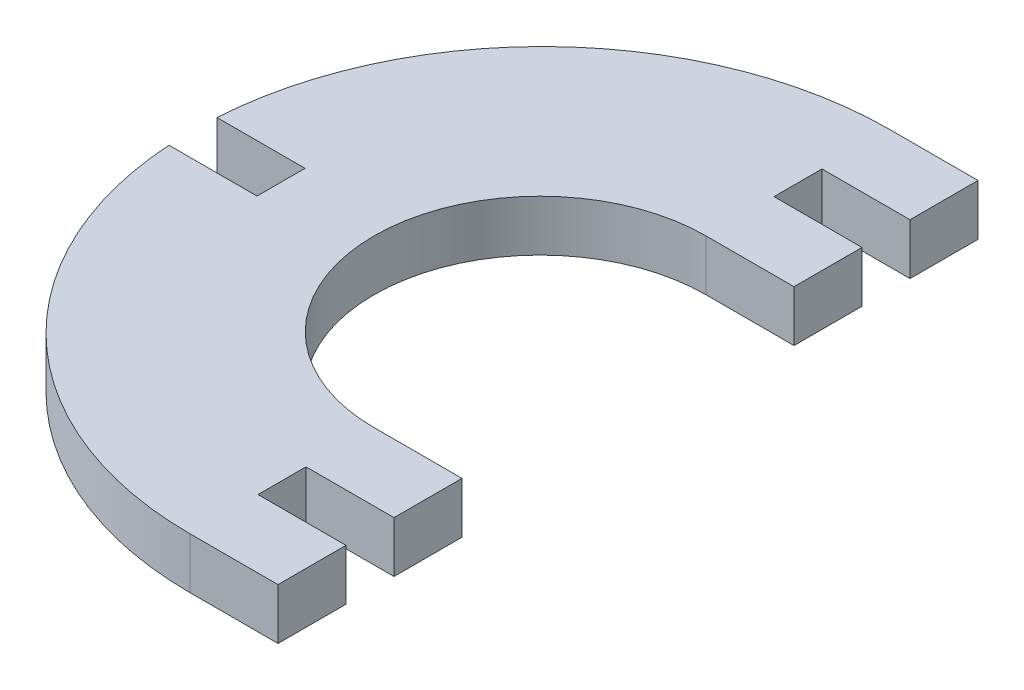
ISO-10303-21;
HEADER;
FILE_DESCRIPTION(('STEP AP214'),'2;1');
FILE_NAME('part.step','',(''),(''),'','','');
FILE_SCHEMA(('AUTOMOTIVE_DESIGN { 1 0 10303 214 1 1 1 1 }'));
ENDSEC;
DATA;
#1=APPLICATION_CONTEXT('core data for automotive mechanical design processes');
#2=APPLICATION_PROTOCOL_DEFINITION('international standard','automotive_design',2000,#1);
#3=PRODUCT_CONTEXT('',#1,'mechanical');
#4=PRODUCT('Part','Part','',(#3));
#5=PRODUCT_RELATED_PRODUCT_CATEGORY('part','',(#4));
#6=PRODUCT_DEFINITION_FORMATION('','',#4);
#7=PRODUCT_DEFINITION_CONTEXT('part definition',#1,'design');
#8=PRODUCT_DEFINITION('design','',#6,#7);
#9=PRODUCT_DEFINITION_SHAPE('','',#8);
#10=(LENGTH_UNIT() NAMED_UNIT(*) SI_UNIT(.MILLI.,.METRE.));
#11=(NAMED_UNIT(*) PLANE_ANGLE_UNIT() SI_UNIT($,.RADIAN.));
#12=(NAMED_UNIT(*) SI_UNIT($,.STERADIAN.) SOLID_ANGLE_UNIT());
#13=UNCERTAINTY_MEASURE_WITH_UNIT(LENGTH_MEASURE(1.E-05),#10,'distance_accuracy_value','');
#14=(GEOMETRIC_REPRESENTATION_CONTEXT(3) GLOBAL_UNCERTAINTY_ASSIGNED_CONTEXT((#13)) GLOBAL_UNIT_ASSIGNED_CONTEXT((#10,
#11,#12)) REPRESENTATION_CONTEXT('',''));
#15=CARTESIAN_POINT('',(0.,0.,0.));
#16=DIRECTION('',(0.,0.,1.));
#17=DIRECTION('',(1.,0.,0.));
#18=AXIS2_PLACEMENT_3D('',#15,#16,#17);
#19=CARTESIAN_POINT('',(0.,5.1,0.));
#20=DIRECTION('',(0.,0.,-1.));
#21=DIRECTION('',(-1.,0.,0.));
#22=AXIS2_PLACEMENT_3D('',#19,#20,#21);
#23=PLANE('',#22);
#24=DIRECTION('',(1.,0.,0.));
#25=VECTOR('',#24,1.);
#26=CARTESIAN_POINT('',(0.,0.,0.));
#27=LINE('',#26,#25);
#28=CARTESIAN_POINT('',(-8.8,0.,0.));
#29=VERTEX_POINT('',#28);
#30=CARTESIAN_POINT('',(0.,0.,0.));
#31=VERTEX_POINT('',#30);
#32=EDGE_CURVE('E201',#29,#31,#27,.T.);
#33=ORIENTED_EDGE('',*,*,#32,.T.);
#34=DIRECTION('',(0.,-1.,0.));
#35=VECTOR('',#34,1.);
#36=CARTESIAN_POINT('',(0.,5.1,0.));
#37=LINE('',#36,#35);
#38=CARTESIAN_POINT('',(0.,5.1,0.));
#39=VERTEX_POINT('',#38);
#40=EDGE_CURVE('E11',#39,#31,#37,.T.);
#41=ORIENTED_EDGE('',*,*,#40,.F.);
#42=DIRECTION('',(1.,0.,0.));
#43=VECTOR('',#42,1.);
#44=CARTESIAN_POINT('',(0.,5.1,0.));
#45=LINE('',#44,#43);
#46=CARTESIAN_POINT('',(-8.8,5.1,0.));
#47=VERTEX_POINT('',#46);
#48=EDGE_CURVE('E239',#47,#39,#45,.T.);
#49=ORIENTED_EDGE('',*,*,#48,.F.);
#50=DIRECTION('',(0.,-1.,0.));
#51=VECTOR('',#50,1.);
#52=CARTESIAN_POINT('',(-8.8,5.1,0.));
#53=LINE('',#52,#51);
#54=EDGE_CURVE('E197',#47,#29,#53,.T.);
#55=ORIENTED_EDGE('',*,*,#54,.T.);
#56=EDGE_LOOP('',(#33,#41,#49,#55));
#57=FACE_BOUND('',#56,.T.);
#58=ADVANCED_FACE('F33',(#57),#23,.F.);
#59=CARTESIAN_POINT('',(0.,5.1,0.));
#60=DIRECTION('',(-1.,0.,0.));
#61=DIRECTION('',(0.,0.,1.));
#62=AXIS2_PLACEMENT_3D('',#59,#60,#61);
#63=PLANE('',#62);
#64=DIRECTION('',(0.,0.,-1.));
#65=VECTOR('',#64,1.);
#66=CARTESIAN_POINT('',(0.,0.,0.));
#67=LINE('',#66,#65);
#68=CARTESIAN_POINT('',(0.,0.,-6.8));
#69=VERTEX_POINT('',#68);
#70=EDGE_CURVE('E204',#31,#69,#67,.T.);
#71=ORIENTED_EDGE('',*,*,#70,.T.);
#72=DIRECTION('',(0.,-1.,0.));
#73=VECTOR('',#72,1.);
#74=CARTESIAN_POINT('',(0.,5.1,-6.8));
#75=LINE('',#74,#73);
#76=CARTESIAN_POINT('',(0.,5.1,-6.8));
#77=VERTEX_POINT('',#76);
#78=EDGE_CURVE('E41',#77,#69,#75,.T.);
#79=ORIENTED_EDGE('',*,*,#78,.F.);
#80=DIRECTION('',(0.,0.,-1.));
#81=VECTOR('',#80,1.);
#82=CARTESIAN_POINT('',(0.,5.1,0.));
#83=LINE('',#82,#81);
#84=EDGE_CURVE('E128',#39,#77,#83,.T.);
#85=ORIENTED_EDGE('',*,*,#84,.F.);
#86=ORIENTED_EDGE('',*,*,#40,.T.);
#87=EDGE_LOOP('',(#71,#79,#85,#86));
#88=FACE_BOUND('',#87,.T.);
#89=ADVANCED_FACE('F357',(#88),#63,.F.);
#90=CARTESIAN_POINT('',(0.,5.1,-6.8));
#91=DIRECTION('',(0.,0.,1.));
#92=DIRECTION('',(1.,0.,0.));
#93=AXIS2_PLACEMENT_3D('',#90,#91,#92);
#94=PLANE('',#93);
#95=DIRECTION('',(-1.,0.,0.));
#96=VECTOR('',#95,1.);
#97=CARTESIAN_POINT('',(0.,0.,-6.8));
#98=LINE('',#97,#96);
#99=CARTESIAN_POINT('',(-8.8,0.,-6.8));
#100=VERTEX_POINT('',#99);
#101=EDGE_CURVE('E206',#69,#100,#98,.T.);
#102=ORIENTED_EDGE('',*,*,#101,.T.);
#103=DIRECTION('',(0.,-1.,0.));
#104=VECTOR('',#103,1.);
#105=CARTESIAN_POINT('',(-8.8,5.1,-6.8));
#106=LINE('',#105,#104);
#107=CARTESIAN_POINT('',(-8.8,5.1,-6.8));
#108=VERTEX_POINT('',#107);
#109=EDGE_CURVE('E282',#108,#100,#106,.T.);
#110=ORIENTED_EDGE('',*,*,#109,.F.);
#111=DIRECTION('',(-1.,0.,0.));
#112=VECTOR('',#111,1.);
#113=CARTESIAN_POINT('',(0.,5.1,-6.8));
#114=LINE('',#113,#112);
#115=EDGE_CURVE('E290',#77,#108,#114,.T.);
#116=ORIENTED_EDGE('',*,*,#115,.F.);
#117=ORIENTED_EDGE('',*,*,#78,.T.);
#118=EDGE_LOOP('',(#102,#110,#116,#117));
#119=FACE_BOUND('',#118,.T.);
#120=ADVANCED_FACE('F288',(#119),#94,.F.);
#121=CARTESIAN_POINT('',(-8.8,5.1,-6.8));
#122=DIRECTION('',(-1.,0.,0.));
#123=DIRECTION('',(0.,0.,1.));
#124=AXIS2_PLACEMENT_3D('',#121,#122,#123);
#125=PLANE('',#124);
#126=DIRECTION('',(0.,0.,-1.));
#127=VECTOR('',#126,1.);
#128=CARTESIAN_POINT('',(-8.8,0.,-6.8));
#129=LINE('',#128,#127);
#130=CARTESIAN_POINT('',(-8.8,0.,-11.6));
#131=VERTEX_POINT('',#130);
#132=EDGE_CURVE('E208',#100,#131,#129,.T.);
#133=ORIENTED_EDGE('',*,*,#132,.T.);
#134=DIRECTION('',(0.,-1.,0.));
#135=VECTOR('',#134,1.);
#136=CARTESIAN_POINT('',(-8.8,5.1,-11.6));
#137=LINE('',#136,#135);
#138=CARTESIAN_POINT('',(-8.8,5.1,-11.6));
#139=VERTEX_POINT('',#138);
#140=EDGE_CURVE('E279',#139,#131,#137,.T.);
#141=ORIENTED_EDGE('',*,*,#140,.F.);
#142=DIRECTION('',(0.,0.,-1.));
#143=VECTOR('',#142,1.);
#144=CARTESIAN_POINT('',(-8.8,5.1,-6.8));
#145=LINE('',#144,#143);
#146=EDGE_CURVE('E308',#108,#139,#145,.T.);
#147=ORIENTED_EDGE('',*,*,#146,.F.);
#148=ORIENTED_EDGE('',*,*,#109,.T.);
#149=EDGE_LOOP('',(#133,#141,#147,#148));
#150=FACE_BOUND('',#149,.T.);
#151=ADVANCED_FACE('F299',(#150),#125,.F.);
#152=CARTESIAN_POINT('',(-8.8,5.1,-11.6));
#153=DIRECTION('',(0.,0.,-1.));
#154=DIRECTION('',(-1.,0.,0.));
#155=AXIS2_PLACEMENT_3D('',#152,#153,#154);
#156=PLANE('',#155);
#157=DIRECTION('',(1.,0.,0.));
#158=VECTOR('',#157,1.);
#159=CARTESIAN_POINT('',(-8.8,0.,-11.6));
#160=LINE('',#159,#158);
#161=CARTESIAN_POINT('',(0.,0.,-11.6));
#162=VERTEX_POINT('',#161);
#163=EDGE_CURVE('E210',#131,#162,#160,.T.);
#164=ORIENTED_EDGE('',*,*,#163,.T.);
#165=DIRECTION('',(0.,-1.,0.));
#166=VECTOR('',#165,1.);
#167=CARTESIAN_POINT('',(0.,5.1,-11.6));
#168=LINE('',#167,#166);
#169=CARTESIAN_POINT('',(0.,5.1,-11.6));
#170=VERTEX_POINT('',#169);
#171=EDGE_CURVE('E276',#170,#162,#168,.T.);
#172=ORIENTED_EDGE('',*,*,#171,.F.);
#173=DIRECTION('',(1.,0.,0.));
#174=VECTOR('',#173,1.);
#175=CARTESIAN_POINT('',(-8.8,5.1,-11.6));
#176=LINE('',#175,#174);
#177=EDGE_CURVE('E305',#139,#170,#176,.T.);
#178=ORIENTED_EDGE('',*,*,#177,.F.);
#179=ORIENTED_EDGE('',*,*,#140,.T.);
#180=EDGE_LOOP('',(#164,#172,#178,#179));
#181=FACE_BOUND('',#180,.T.);
#182=ADVANCED_FACE('F303',(#181),#156,.F.);
#183=CARTESIAN_POINT('',(0.,5.1,-11.6));
#184=DIRECTION('',(-1.,0.,0.));
#185=DIRECTION('',(0.,0.,1.));
#186=AXIS2_PLACEMENT_3D('',#183,#184,#185);
#187=PLANE('',#186);
#188=DIRECTION('',(0.,0.,-1.));
#189=VECTOR('',#188,1.);
#190=CARTESIAN_POINT('',(0.,0.,-11.6));
#191=LINE('',#190,#189);
#192=CARTESIAN_POINT('',(0.,0.,-18.4));
#193=VERTEX_POINT('',#192);
#194=EDGE_CURVE('E212',#162,#193,#191,.T.);
#195=ORIENTED_EDGE('',*,*,#194,.T.);
#196=DIRECTION('',(0.,-1.,0.));
#197=VECTOR('',#196,1.);
#198=CARTESIAN_POINT('',(0.,5.1,-18.4));
#199=LINE('',#198,#197);
#200=CARTESIAN_POINT('',(0.,5.1,-18.4));
#201=VERTEX_POINT('',#200);
#202=EDGE_CURVE('E273',#201,#193,#199,.T.);
#203=ORIENTED_EDGE('',*,*,#202,.F.);
#204=DIRECTION('',(0.,0.,-1.));
#205=VECTOR('',#204,1.);
#206=CARTESIAN_POINT('',(0.,5.1,-11.6));
#207=LINE('',#206,#205);
#208=EDGE_CURVE('E307',#170,#201,#207,.T.);
#209=ORIENTED_EDGE('',*,*,#208,.F.);
#210=ORIENTED_EDGE('',*,*,#171,.T.);
#211=EDGE_LOOP('',(#195,#203,#209,#210));
#212=FACE_BOUND('',#211,.T.);
#213=ADVANCED_FACE('F370',(#212),#187,.F.);
#214=CARTESIAN_POINT('',(0.,5.1,-18.4));
#215=DIRECTION('',(0.,0.,1.));
#216=DIRECTION('',(1.,0.,0.));
#217=AXIS2_PLACEMENT_3D('',#214,#215,#216);
#218=PLANE('',#217);
#219=DIRECTION('',(-1.,0.,0.));
#220=VECTOR('',#219,1.);
#221=CARTESIAN_POINT('',(0.,0.,-18.4));
#222=LINE('',#221,#220);
#223=CARTESIAN_POINT('',(-8.8,0.,-18.4));
#224=VERTEX_POINT('',#223);
#225=EDGE_CURVE('E214',#193,#224,#222,.T.);
#226=ORIENTED_EDGE('',*,*,#225,.T.);
#227=DIRECTION('',(0.,-1.,0.));
#228=VECTOR('',#227,1.);
#229=CARTESIAN_POINT('',(-8.8,5.1,-18.4));
#230=LINE('',#229,#228);
#231=CARTESIAN_POINT('',(-8.8,5.1,-18.4));
#232=VERTEX_POINT('',#231);
#233=EDGE_CURVE('E270',#232,#224,#230,.T.);
#234=ORIENTED_EDGE('',*,*,#233,.F.);
#235=DIRECTION('',(-1.,0.,0.));
#236=VECTOR('',#235,1.);
#237=CARTESIAN_POINT('',(0.,5.1,-18.4));
#238=LINE('',#237,#236);
#239=EDGE_CURVE('E310',#201,#232,#238,.T.);
#240=ORIENTED_EDGE('',*,*,#239,.F.);
#241=ORIENTED_EDGE('',*,*,#202,.T.);
#242=EDGE_LOOP('',(#226,#234,#240,#241));
#243=FACE_BOUND('',#242,.T.);
#244=ADVANCED_FACE('F373',(#243),#218,.F.);
#245=CARTESIAN_POINT('',(-8.8,5.1,-35.));
#246=DIRECTION('',(0.,-1.,0.));
#247=DIRECTION('',(0.,0.,-1.));
#248=AXIS2_PLACEMENT_3D('',#245,#246,#247);
#249=CYLINDRICAL_SURFACE('',#248,16.6);
#250=CARTESIAN_POINT('',(-8.8,0.,-35.));
#251=DIRECTION('',(0.,-1.,0.));
#252=DIRECTION('',(0.,0.,1.));
#253=AXIS2_PLACEMENT_3D('',#250,#251,#252);
#254=CIRCLE('',#253,16.6);
#255=CARTESIAN_POINT('',(-8.8,0.,-51.6));
#256=VERTEX_POINT('',#255);
#257=EDGE_CURVE('E216',#224,#256,#254,.T.);
#258=ORIENTED_EDGE('',*,*,#257,.T.);
#259=DIRECTION('',(0.,-1.,0.));
#260=VECTOR('',#259,1.);
#261=CARTESIAN_POINT('',(-8.8,5.1,-51.6));
#262=LINE('',#261,#260);
#263=CARTESIAN_POINT('',(-8.8,5.1,-51.6));
#264=VERTEX_POINT('',#263);
#265=EDGE_CURVE('E267',#264,#256,#262,.T.);
#266=ORIENTED_EDGE('',*,*,#265,.F.);
#267=CARTESIAN_POINT('',(-8.8,5.1,-35.));
#268=DIRECTION('',(0.,-1.,0.));
#269=DIRECTION('',(0.,0.,1.));
#270=AXIS2_PLACEMENT_3D('',#267,#268,#269);
#271=CIRCLE('',#270,16.6);
#272=EDGE_CURVE('E316',#232,#264,#271,.T.);
#273=ORIENTED_EDGE('',*,*,#272,.F.);
#274=ORIENTED_EDGE('',*,*,#233,.T.);
#275=EDGE_LOOP('',(#258,#266,#273,#274));
#276=FACE_BOUND('',#275,.T.);
#277=ADVANCED_FACE('F377',(#276),#249,.F.);
#278=CARTESIAN_POINT('',(-8.8,5.1,-51.6));
#279=DIRECTION('',(0.,0.,-1.));
#280=DIRECTION('',(-1.,0.,0.));
#281=AXIS2_PLACEMENT_3D('',#278,#279,#280);
#282=PLANE('',#281);
#283=DIRECTION('',(1.,0.,0.));
#284=VECTOR('',#283,1.);
#285=CARTESIAN_POINT('',(-8.8,0.,-51.6));
#286=LINE('',#285,#284);
#287=CARTESIAN_POINT('',(0.,0.,-51.6));
#288=VERTEX_POINT('',#287);
#289=EDGE_CURVE('E218',#256,#288,#286,.T.);
#290=ORIENTED_EDGE('',*,*,#289,.T.);
#291=DIRECTION('',(0.,-1.,0.));
#292=VECTOR('',#291,1.);
#293=CARTESIAN_POINT('',(0.,5.1,-51.6));
#294=LINE('',#293,#292);
#295=CARTESIAN_POINT('',(0.,5.1,-51.6));
#296=VERTEX_POINT('',#295);
#297=EDGE_CURVE('E264',#296,#288,#294,.T.);
#298=ORIENTED_EDGE('',*,*,#297,.F.);
#299=DIRECTION('',(1.,0.,0.));
#300=VECTOR('',#299,1.);
#301=CARTESIAN_POINT('',(-8.8,5.1,-51.6));
#302=LINE('',#301,#300);
#303=EDGE_CURVE('E318',#264,#296,#302,.T.);
#304=ORIENTED_EDGE('',*,*,#303,.F.);
#305=ORIENTED_EDGE('',*,*,#265,.T.);
#306=EDGE_LOOP('',(#290,#298,#304,#305));
#307=FACE_BOUND('',#306,.T.);
#308=ADVANCED_FACE('F381',(#307),#282,.F.);
#309=CARTESIAN_POINT('',(0.,5.1,-51.6));
#310=DIRECTION('',(-1.,0.,0.));
#311=DIRECTION('',(0.,0.,1.));
#312=AXIS2_PLACEMENT_3D('',#309,#310,#311);
#313=PLANE('',#312);
#314=DIRECTION('',(0.,0.,-1.));
#315=VECTOR('',#314,1.);
#316=CARTESIAN_POINT('',(0.,0.,-51.6));
#317=LINE('',#316,#315);
#318=CARTESIAN_POINT('',(0.,0.,-58.4));
#319=VERTEX_POINT('',#318);
#320=EDGE_CURVE('E220',#288,#319,#317,.T.);
#321=ORIENTED_EDGE('',*,*,#320,.T.);
#322=DIRECTION('',(0.,-1.,0.));
#323=VECTOR('',#322,1.);
#324=CARTESIAN_POINT('',(0.,5.1,-58.4));
#325=LINE('',#324,#323);
#326=CARTESIAN_POINT('',(0.,5.1,-58.4));
#327=VERTEX_POINT('',#326);
#328=EDGE_CURVE('E261',#327,#319,#325,.T.);
#329=ORIENTED_EDGE('',*,*,#328,.F.);
#330=DIRECTION('',(0.,0.,-1.));
#331=VECTOR('',#330,1.);
#332=CARTESIAN_POINT('',(0.,5.1,-51.6));
#333=LINE('',#332,#331);
#334=EDGE_CURVE('E320',#296,#327,#333,.T.);
#335=ORIENTED_EDGE('',*,*,#334,.F.);
#336=ORIENTED_EDGE('',*,*,#297,.T.);
#337=EDGE_LOOP('',(#321,#329,#335,#336));
#338=FACE_BOUND('',#337,.T.);
#339=ADVANCED_FACE('F385',(#338),#313,.F.);
#340=CARTESIAN_POINT('',(0.,5.1,-58.4));
#341=DIRECTION('',(0.,0.,1.));
#342=DIRECTION('',(1.,0.,0.));
#343=AXIS2_PLACEMENT_3D('',#340,#341,#342);
#344=PLANE('',#343);
#345=DIRECTION('',(-1.,0.,0.));
#346=VECTOR('',#345,1.);
#347=CARTESIAN_POINT('',(0.,0.,-58.4));
#348=LINE('',#347,#346);
#349=CARTESIAN_POINT('',(-8.8,0.,-58.4));
#350=VERTEX_POINT('',#349);
#351=EDGE_CURVE('E222',#319,#350,#348,.T.);
#352=ORIENTED_EDGE('',*,*,#351,.T.);
#353=DIRECTION('',(0.,-1.,0.));
#354=VECTOR('',#353,1.);
#355=CARTESIAN_POINT('',(-8.8,5.1,-58.4));
#356=LINE('',#355,#354);
#357=CARTESIAN_POINT('',(-8.8,5.1,-58.4));
#358=VERTEX_POINT('',#357);
#359=EDGE_CURVE('E258',#358,#350,#356,.T.);
#360=ORIENTED_EDGE('',*,*,#359,.F.);
#361=DIRECTION('',(-1.,0.,0.));
#362=VECTOR('',#361,1.);
#363=CARTESIAN_POINT('',(0.,5.1,-58.4));
#364=LINE('',#363,#362);
#365=EDGE_CURVE('E322',#327,#358,#364,.T.);
#366=ORIENTED_EDGE('',*,*,#365,.F.);
#367=ORIENTED_EDGE('',*,*,#328,.T.);
#368=EDGE_LOOP('',(#352,#360,#366,#367));
#369=FACE_BOUND('',#368,.T.);
#370=ADVANCED_FACE('F389',(#369),#344,.F.);
#371=CARTESIAN_POINT('',(-8.8,5.1,-58.4));
#372=DIRECTION('',(-1.,0.,0.));
#373=DIRECTION('',(0.,0.,1.));
#374=AXIS2_PLACEMENT_3D('',#371,#372,#373);
#375=PLANE('',#374);
#376=DIRECTION('',(0.,0.,-1.));
#377=VECTOR('',#376,1.);
#378=CARTESIAN_POINT('',(-8.8,0.,-58.4));
#379=LINE('',#378,#377);
#380=CARTESIAN_POINT('',(-8.8,0.,-63.2));
#381=VERTEX_POINT('',#380);
#382=EDGE_CURVE('E224',#350,#381,#379,.T.);
#383=ORIENTED_EDGE('',*,*,#382,.T.);
#384=DIRECTION('',(0.,-1.,0.));
#385=VECTOR('',#384,1.);
#386=CARTESIAN_POINT('',(-8.8,5.1,-63.2));
#387=LINE('',#386,#385);
#388=CARTESIAN_POINT('',(-8.8,5.1,-63.2));
#389=VERTEX_POINT('',#388);
#390=EDGE_CURVE('E255',#389,#381,#387,.T.);
#391=ORIENTED_EDGE('',*,*,#390,.F.);
#392=DIRECTION('',(0.,0.,-1.));
#393=VECTOR('',#392,1.);
#394=CARTESIAN_POINT('',(-8.8,5.1,-58.4));
#395=LINE('',#394,#393);
#396=EDGE_CURVE('E324',#358,#389,#395,.T.);
#397=ORIENTED_EDGE('',*,*,#396,.F.);
#398=ORIENTED_EDGE('',*,*,#359,.T.);
#399=EDGE_LOOP('',(#383,#391,#397,#398));
#400=FACE_BOUND('',#399,.T.);
#401=ADVANCED_FACE('F393',(#400),#375,.F.);
#402=CARTESIAN_POINT('',(-8.8,5.1,-63.2));
#403=DIRECTION('',(0.,0.,-1.));
#404=DIRECTION('',(-1.,0.,0.));
#405=AXIS2_PLACEMENT_3D('',#402,#403,#404);
#406=PLANE('',#405);
#407=DIRECTION('',(1.,0.,0.));
#408=VECTOR('',#407,1.);
#409=CARTESIAN_POINT('',(-8.8,0.,-63.2));
#410=LINE('',#409,#408);
#411=CARTESIAN_POINT('',(0.,0.,-63.2));
#412=VERTEX_POINT('',#411);
#413=EDGE_CURVE('E226',#381,#412,#410,.T.);
#414=ORIENTED_EDGE('',*,*,#413,.T.);
#415=DIRECTION('',(0.,-1.,0.));
#416=VECTOR('',#415,1.);
#417=CARTESIAN_POINT('',(0.,5.1,-63.2));
#418=LINE('',#417,#416);
#419=CARTESIAN_POINT('',(0.,5.1,-63.2));
#420=VERTEX_POINT('',#419);
#421=EDGE_CURVE('E252',#420,#412,#418,.T.);
#422=ORIENTED_EDGE('',*,*,#421,.F.);
#423=DIRECTION('',(1.,0.,0.));
#424=VECTOR('',#423,1.);
#425=CARTESIAN_POINT('',(-8.8,5.1,-63.2));
#426=LINE('',#425,#424);
#427=EDGE_CURVE('E326',#389,#420,#426,.T.);
#428=ORIENTED_EDGE('',*,*,#427,.F.);
#429=ORIENTED_EDGE('',*,*,#390,.T.);
#430=EDGE_LOOP('',(#414,#422,#428,#429));
#431=FACE_BOUND('',#430,.T.);
#432=ADVANCED_FACE('F397',(#431),#406,.F.);
#433=CARTESIAN_POINT('',(0.,5.1,-63.2));
#434=DIRECTION('',(-1.,0.,0.));
#435=DIRECTION('',(0.,0.,1.));
#436=AXIS2_PLACEMENT_3D('',#433,#434,#435);
#437=PLANE('',#436);
#438=DIRECTION('',(0.,0.,-1.));
#439=VECTOR('',#438,1.);
#440=CARTESIAN_POINT('',(0.,0.,-63.2));
#441=LINE('',#440,#439);
#442=CARTESIAN_POINT('',(0.,0.,-70.));
#443=VERTEX_POINT('',#442);
#444=EDGE_CURVE('E228',#412,#443,#441,.T.);
#445=ORIENTED_EDGE('',*,*,#444,.T.);
#446=DIRECTION('',(0.,-1.,0.));
#447=VECTOR('',#446,1.);
#448=CARTESIAN_POINT('',(0.,5.1,-70.));
#449=LINE('',#448,#447);
#450=CARTESIAN_POINT('',(0.,5.1,-70.));
#451=VERTEX_POINT('',#450);
#452=EDGE_CURVE('E249',#451,#443,#449,.T.);
#453=ORIENTED_EDGE('',*,*,#452,.F.);
#454=DIRECTION('',(0.,0.,-1.));
#455=VECTOR('',#454,1.);
#456=CARTESIAN_POINT('',(0.,5.1,-63.2));
#457=LINE('',#456,#455);
#458=EDGE_CURVE('E328',#420,#451,#457,.T.);
#459=ORIENTED_EDGE('',*,*,#458,.F.);
#460=ORIENTED_EDGE('',*,*,#421,.T.);
#461=EDGE_LOOP('',(#445,#453,#459,#460));
#462=FACE_BOUND('',#461,.T.);
#463=ADVANCED_FACE('F401',(#462),#437,.F.);
#464=CARTESIAN_POINT('',(0.,5.1,-70.));
#465=DIRECTION('',(0.,0.,1.));
#466=DIRECTION('',(1.,0.,0.));
#467=AXIS2_PLACEMENT_3D('',#464,#465,#466);
#468=PLANE('',#467);
#469=DIRECTION('',(-1.,0.,0.));
#470=VECTOR('',#469,1.);
#471=CARTESIAN_POINT('',(0.,0.,-70.));
#472=LINE('',#471,#470);
#473=CARTESIAN_POINT('',(-8.8,0.,-70.));
#474=VERTEX_POINT('',#473);
#475=EDGE_CURVE('E230',#443,#474,#472,.T.);
#476=ORIENTED_EDGE('',*,*,#475,.T.);
#477=DIRECTION('',(0.,-1.,0.));
#478=VECTOR('',#477,1.);
#479=CARTESIAN_POINT('',(-8.8,5.1,-70.));
#480=LINE('',#479,#478);
#481=CARTESIAN_POINT('',(-8.8,5.1,-70.));
#482=VERTEX_POINT('',#481);
#483=EDGE_CURVE('E246',#482,#474,#480,.T.);
#484=ORIENTED_EDGE('',*,*,#483,.F.);
#485=DIRECTION('',(-1.,0.,0.));
#486=VECTOR('',#485,1.);
#487=CARTESIAN_POINT('',(0.,5.1,-70.));
#488=LINE('',#487,#486);
#489=EDGE_CURVE('E330',#451,#482,#488,.T.);
#490=ORIENTED_EDGE('',*,*,#489,.F.);
#491=ORIENTED_EDGE('',*,*,#452,.T.);
#492=EDGE_LOOP('',(#476,#484,#490,#491));
#493=FACE_BOUND('',#492,.T.);
#494=ADVANCED_FACE('F405',(#493),#468,.F.);
#495=CARTESIAN_POINT('',(-8.80000000000001,5.1,-35.2323619631902));
#496=DIRECTION('',(0.,-1.,0.));
#497=DIRECTION('',(0.,0.,-1.));
#498=AXIS2_PLACEMENT_3D('',#495,#496,#497);
#499=CYLINDRICAL_SURFACE('',#498,34.7676380368098);
#500=CARTESIAN_POINT('',(-8.80000000000001,0.,-35.2323619631902));
#501=DIRECTION('',(0.,1.,0.));
#502=DIRECTION('',(0.,0.,1.));
#503=AXIS2_PLACEMENT_3D('',#500,#501,#502);
#504=CIRCLE('',#503,34.7676380368098);
#505=CARTESIAN_POINT('',(-43.5,0.,-37.4));
#506=VERTEX_POINT('',#505);
#507=EDGE_CURVE('E232',#474,#506,#504,.T.);
#508=ORIENTED_EDGE('',*,*,#507,.T.);
#509=DIRECTION('',(0.,-1.,0.));
#510=VECTOR('',#509,1.);
#511=CARTESIAN_POINT('',(-43.5,5.1,-37.4));
#512=LINE('',#511,#510);
#513=CARTESIAN_POINT('',(-43.5,5.1,-37.4));
#514=VERTEX_POINT('',#513);
#515=EDGE_CURVE('E243',#514,#506,#512,.T.);
#516=ORIENTED_EDGE('',*,*,#515,.F.);
#517=CARTESIAN_POINT('',(-8.80000000000001,5.1,-35.2323619631902));
#518=DIRECTION('',(0.,1.,0.));
#519=DIRECTION('',(0.,0.,1.));
#520=AXIS2_PLACEMENT_3D('',#517,#518,#519);
#521=CIRCLE('',#520,34.7676380368098);
#522=EDGE_CURVE('E332',#482,#514,#521,.T.);
#523=ORIENTED_EDGE('',*,*,#522,.F.);
#524=ORIENTED_EDGE('',*,*,#483,.T.);
#525=EDGE_LOOP('',(#508,#516,#523,#524));
#526=FACE_BOUND('',#525,.T.);
#527=ADVANCED_FACE('F338',(#526),#499,.T.);
#528=CARTESIAN_POINT('',(-34.7,5.1,-37.4));
#529=DIRECTION('',(0.,0.,-1.));
#530=DIRECTION('',(-1.,0.,0.));
#531=AXIS2_PLACEMENT_3D('',#528,#529,#530);
#532=PLANE('',#531);
#533=DIRECTION('',(1.,0.,0.));
#534=VECTOR('',#533,1.);
#535=CARTESIAN_POINT('',(-34.7,0.,-37.4));
#536=LINE('',#535,#534);
#537=CARTESIAN_POINT('',(-34.7,0.,-37.4));
#538=VERTEX_POINT('',#537);
#539=EDGE_CURVE('E234',#506,#538,#536,.T.);
#540=ORIENTED_EDGE('',*,*,#539,.T.);
#541=DIRECTION('',(0.,-1.,0.));
#542=VECTOR('',#541,1.);
#543=CARTESIAN_POINT('',(-34.7,5.1,-37.4));
#544=LINE('',#543,#542);
#545=CARTESIAN_POINT('',(-34.7,5.1,-37.4));
#546=VERTEX_POINT('',#545);
#547=EDGE_CURVE('E192',#546,#538,#544,.T.);
#548=ORIENTED_EDGE('',*,*,#547,.F.);
#549=DIRECTION('',(1.,0.,0.));
#550=VECTOR('',#549,1.);
#551=CARTESIAN_POINT('',(-34.7,5.1,-37.4));
#552=LINE('',#551,#550);
#553=EDGE_CURVE('E183',#514,#546,#552,.T.);
#554=ORIENTED_EDGE('',*,*,#553,.F.);
#555=ORIENTED_EDGE('',*,*,#515,.T.);
#556=EDGE_LOOP('',(#540,#548,#554,#555));
#557=FACE_BOUND('',#556,.T.);
#558=ADVANCED_FACE('F342',(#557),#532,.F.);
#559=CARTESIAN_POINT('',(-34.7,5.1,-37.4));
#560=DIRECTION('',(1.,0.,0.));
#561=DIRECTION('',(0.,0.,-1.));
#562=AXIS2_PLACEMENT_3D('',#559,#560,#561);
#563=PLANE('',#562);
#564=DIRECTION('',(0.,0.,1.));
#565=VECTOR('',#564,1.);
#566=CARTESIAN_POINT('',(-34.7,0.,-37.4));
#567=LINE('',#566,#565);
#568=CARTESIAN_POINT('',(-34.7,0.,-32.6));
#569=VERTEX_POINT('',#568);
#570=EDGE_CURVE('E191',#538,#569,#567,.T.);
#571=ORIENTED_EDGE('',*,*,#570,.T.);
#572=DIRECTION('',(0.,-1.,0.));
#573=VECTOR('',#572,1.);
#574=CARTESIAN_POINT('',(-34.7,5.1,-32.6));
#575=LINE('',#574,#573);
#576=CARTESIAN_POINT('',(-34.7,5.1,-32.6));
#577=VERTEX_POINT('',#576);
#578=EDGE_CURVE('E188',#577,#569,#575,.T.);
#579=ORIENTED_EDGE('',*,*,#578,.F.);
#580=DIRECTION('',(0.,0.,1.));
#581=VECTOR('',#580,1.);
#582=CARTESIAN_POINT('',(-34.7,5.1,-37.4));
#583=LINE('',#582,#581);
#584=EDGE_CURVE('E177',#546,#577,#583,.T.);
#585=ORIENTED_EDGE('',*,*,#584,.F.);
#586=ORIENTED_EDGE('',*,*,#547,.T.);
#587=EDGE_LOOP('',(#571,#579,#585,#586));
#588=FACE_BOUND('',#587,.T.);
#589=ADVANCED_FACE('F189',(#588),#563,.F.);
#590=CARTESIAN_POINT('',(-34.7,5.1,-32.6));
#591=DIRECTION('',(0.,0.,1.));
#592=DIRECTION('',(1.,0.,0.));
#593=AXIS2_PLACEMENT_3D('',#590,#591,#592);
#594=PLANE('',#593);
#595=DIRECTION('',(-1.,0.,0.));
#596=VECTOR('',#595,1.);
#597=CARTESIAN_POINT('',(-34.7,0.,-32.6));
#598=LINE('',#597,#596);
#599=CARTESIAN_POINT('',(-43.5,0.,-32.6));
#600=VERTEX_POINT('',#599);
#601=EDGE_CURVE('E114',#569,#600,#598,.T.);
#602=ORIENTED_EDGE('',*,*,#601,.T.);
#603=DIRECTION('',(0.,-1.,0.));
#604=VECTOR('',#603,1.);
#605=CARTESIAN_POINT('',(-43.5,5.1,-32.6));
#606=LINE('',#605,#604);
#607=CARTESIAN_POINT('',(-43.5,5.1,-32.6));
#608=VERTEX_POINT('',#607);
#609=EDGE_CURVE('E193',#608,#600,#606,.T.);
#610=ORIENTED_EDGE('',*,*,#609,.F.);
#611=DIRECTION('',(-1.,0.,0.));
#612=VECTOR('',#611,1.);
#613=CARTESIAN_POINT('',(-34.7,5.1,-32.6));
#614=LINE('',#613,#612);
#615=EDGE_CURVE('E181',#577,#608,#614,.T.);
#616=ORIENTED_EDGE('',*,*,#615,.F.);
#617=ORIENTED_EDGE('',*,*,#578,.T.);
#618=EDGE_LOOP('',(#602,#610,#616,#617));
#619=FACE_BOUND('',#618,.T.);
#620=ADVANCED_FACE('F195',(#619),#594,.F.);
#621=CARTESIAN_POINT('',(-8.80000000000001,5.1,-34.7676380368098));
#622=DIRECTION('',(0.,-1.,0.));
#623=DIRECTION('',(0.,0.,-1.));
#624=AXIS2_PLACEMENT_3D('',#621,#622,#623);
#625=CYLINDRICAL_SURFACE('',#624,34.7676380368098);
#626=CARTESIAN_POINT('',(-8.80000000000001,0.,-34.7676380368098));
#627=DIRECTION('',(0.,1.,0.));
#628=DIRECTION('',(0.,0.,-1.));
#629=AXIS2_PLACEMENT_3D('',#626,#627,#628);
#630=CIRCLE('',#629,34.7676380368098);
#631=EDGE_CURVE('E120',#600,#29,#630,.T.);
#632=ORIENTED_EDGE('',*,*,#631,.T.);
#633=ORIENTED_EDGE('',*,*,#54,.F.);
#634=CARTESIAN_POINT('',(-8.80000000000001,5.1,-34.7676380368098));
#635=DIRECTION('',(0.,1.,0.));
#636=DIRECTION('',(0.,0.,-1.));
#637=AXIS2_PLACEMENT_3D('',#634,#635,#636);
#638=CIRCLE('',#637,34.7676380368098);
#639=EDGE_CURVE('E49',#608,#47,#638,.T.);
#640=ORIENTED_EDGE('',*,*,#639,.F.);
#641=ORIENTED_EDGE('',*,*,#609,.T.);
#642=EDGE_LOOP('',(#632,#633,#640,#641));
#643=FACE_BOUND('',#642,.T.);
#644=ADVANCED_FACE('F346',(#643),#625,.T.);
#645=CARTESIAN_POINT('',(-8.80000000000001,5.1,-34.7676380368098));
#646=DIRECTION('',(0.,-1.,0.));
#647=DIRECTION('',(0.,0.,-1.));
#648=AXIS2_PLACEMENT_3D('',#645,#646,#647);
#649=PLANE('',#648);
#650=ORIENTED_EDGE('',*,*,#48,.T.);
#651=ORIENTED_EDGE('',*,*,#84,.T.);
#652=ORIENTED_EDGE('',*,*,#115,.T.);
#653=ORIENTED_EDGE('',*,*,#146,.T.);
#654=ORIENTED_EDGE('',*,*,#177,.T.);
#655=ORIENTED_EDGE('',*,*,#208,.T.);
#656=ORIENTED_EDGE('',*,*,#239,.T.);
#657=ORIENTED_EDGE('',*,*,#272,.T.);
#658=ORIENTED_EDGE('',*,*,#303,.T.);
#659=ORIENTED_EDGE('',*,*,#334,.T.);
#660=ORIENTED_EDGE('',*,*,#365,.T.);
#661=ORIENTED_EDGE('',*,*,#396,.T.);
#662=ORIENTED_EDGE('',*,*,#427,.T.);
#663=ORIENTED_EDGE('',*,*,#458,.T.);
#664=ORIENTED_EDGE('',*,*,#489,.T.);
#665=ORIENTED_EDGE('',*,*,#522,.T.);
#666=ORIENTED_EDGE('',*,*,#553,.T.);
#667=ORIENTED_EDGE('',*,*,#584,.T.);
#668=ORIENTED_EDGE('',*,*,#615,.T.);
#669=ORIENTED_EDGE('',*,*,#639,.T.);
#670=EDGE_LOOP('',(#650,#651,#652,#653,#654,#655,#656,#657,#658,#659,#660,#661,#662,#663,#664,
#665,#666,#667,#668,#669));
#671=FACE_BOUND('',#670,.T.);
#672=ADVANCED_FACE('F179',(#671),#649,.F.);
#673=CARTESIAN_POINT('',(-8.80000000000001,0.,-34.7676380368098));
#674=DIRECTION('',(0.,-1.,0.));
#675=DIRECTION('',(0.,0.,-1.));
#676=AXIS2_PLACEMENT_3D('',#673,#674,#675);
#677=PLANE('',#676);
#678=ORIENTED_EDGE('',*,*,#32,.F.);
#679=ORIENTED_EDGE('',*,*,#631,.F.);
#680=ORIENTED_EDGE('',*,*,#601,.F.);
#681=ORIENTED_EDGE('',*,*,#570,.F.);
#682=ORIENTED_EDGE('',*,*,#539,.F.);
#683=ORIENTED_EDGE('',*,*,#507,.F.);
#684=ORIENTED_EDGE('',*,*,#475,.F.);
#685=ORIENTED_EDGE('',*,*,#444,.F.);
#686=ORIENTED_EDGE('',*,*,#413,.F.);
#687=ORIENTED_EDGE('',*,*,#382,.F.);
#688=ORIENTED_EDGE('',*,*,#351,.F.);
#689=ORIENTED_EDGE('',*,*,#320,.F.);
#690=ORIENTED_EDGE('',*,*,#289,.F.);
#691=ORIENTED_EDGE('',*,*,#257,.F.);
#692=ORIENTED_EDGE('',*,*,#225,.F.);
#693=ORIENTED_EDGE('',*,*,#194,.F.);
#694=ORIENTED_EDGE('',*,*,#163,.F.);
#695=ORIENTED_EDGE('',*,*,#132,.F.);
#696=ORIENTED_EDGE('',*,*,#101,.F.);
#697=ORIENTED_EDGE('',*,*,#70,.F.);
#698=EDGE_LOOP('',(#678,#679,#680,#681,#682,#683,#684,#685,#686,#687,#688,#689,#690,#691,#692,
#693,#694,#695,#696,#697));
#699=FACE_BOUND('',#698,.T.);
#700=ADVANCED_FACE('F294',(#699),#677,.T.);
#701=CLOSED_SHELL('',(#58,#89,#120,#151,#182,#213,#244,#277,#308,#339,#370,#401,#432,#463,#494,
#527,#558,#589,#620,#644,#672,#700));
#702=MANIFOLD_SOLID_BREP('B2',#701);
#703=ADVANCED_BREP_SHAPE_REPRESENTATION('',(#18,#702),#14);
#704=SHAPE_DEFINITION_REPRESENTATION(#9,#703);
ENDSEC;
END-ISO-10303-21;
